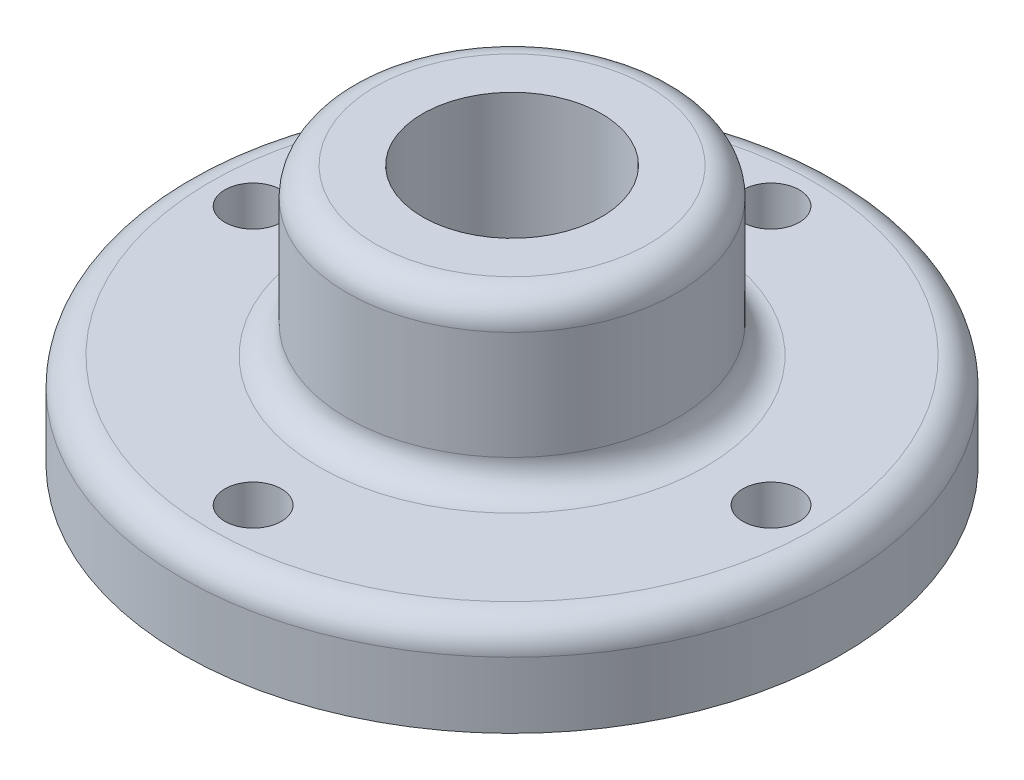
ISO-10303-21;
HEADER;
FILE_DESCRIPTION(('STEP AP214'),'2;1');
FILE_NAME('part.step','',(''),(''),'','','');
FILE_SCHEMA(('AUTOMOTIVE_DESIGN { 1 0 10303 214 1 1 1 1 }'));
ENDSEC;
DATA;
#1=APPLICATION_CONTEXT('core data for automotive mechanical design processes');
#2=APPLICATION_PROTOCOL_DEFINITION('international standard','automotive_design',2000,#1);
#3=PRODUCT_CONTEXT('',#1,'mechanical');
#4=PRODUCT('Part','Part','',(#3));
#5=PRODUCT_RELATED_PRODUCT_CATEGORY('part','',(#4));
#6=PRODUCT_DEFINITION_FORMATION('','',#4);
#7=PRODUCT_DEFINITION_CONTEXT('part definition',#1,'design');
#8=PRODUCT_DEFINITION('design','',#6,#7);
#9=PRODUCT_DEFINITION_SHAPE('','',#8);
#10=(LENGTH_UNIT() NAMED_UNIT(*) SI_UNIT(.MILLI.,.METRE.));
#11=(NAMED_UNIT(*) PLANE_ANGLE_UNIT() SI_UNIT($,.RADIAN.));
#12=(NAMED_UNIT(*) SI_UNIT($,.STERADIAN.) SOLID_ANGLE_UNIT());
#13=UNCERTAINTY_MEASURE_WITH_UNIT(LENGTH_MEASURE(1.E-05),#10,'distance_accuracy_value','');
#14=(GEOMETRIC_REPRESENTATION_CONTEXT(3) GLOBAL_UNCERTAINTY_ASSIGNED_CONTEXT((#13)) GLOBAL_UNIT_ASSIGNED_CONTEXT((#10,
#11,#12)) REPRESENTATION_CONTEXT('',''));
#15=CARTESIAN_POINT('',(0.,0.,0.));
#16=DIRECTION('',(0.,0.,1.));
#17=DIRECTION('',(1.,0.,0.));
#18=AXIS2_PLACEMENT_3D('',#15,#16,#17);
#19=CARTESIAN_POINT('',(-55.,20.,0.));
#20=DIRECTION('',(0.,-1.,0.));
#21=DIRECTION('',(0.,0.,-1.));
#22=AXIS2_PLACEMENT_3D('',#19,#20,#21);
#23=CYLINDRICAL_SURFACE('',#22,5.99999999999999);
#24=CARTESIAN_POINT('',(-55.,20.,0.));
#25=DIRECTION('',(0.,1.,0.));
#26=DIRECTION('',(0.,0.,1.));
#27=AXIS2_PLACEMENT_3D('',#24,#25,#26);
#28=CIRCLE('',#27,5.99999999999999);
#29=CARTESIAN_POINT('',(-55.,20.,5.99999999999999));
#30=VERTEX_POINT('',#29);
#31=EDGE_CURVE('E57',#30,#30,#28,.T.);
#32=ORIENTED_EDGE('',*,*,#31,.T.);
#33=EDGE_LOOP('',(#32));
#34=FACE_BOUND('',#33,.T.);
#35=CARTESIAN_POINT('',(-55.,0.,0.));
#36=DIRECTION('',(0.,1.,0.));
#37=DIRECTION('',(0.,0.,1.));
#38=AXIS2_PLACEMENT_3D('',#35,#36,#37);
#39=CIRCLE('',#38,5.99999999999999);
#40=CARTESIAN_POINT('',(-55.,0.,5.99999999999999));
#41=VERTEX_POINT('',#40);
#42=EDGE_CURVE('E62',#41,#41,#39,.T.);
#43=ORIENTED_EDGE('',*,*,#42,.F.);
#44=EDGE_LOOP('',(#43));
#45=FACE_BOUND('',#44,.T.);
#46=ADVANCED_FACE('F31',(#34,#45),#23,.F.);
#47=CARTESIAN_POINT('',(0.,20.,-55.));
#48=DIRECTION('',(0.,-1.,0.));
#49=DIRECTION('',(0.,0.,-1.));
#50=AXIS2_PLACEMENT_3D('',#47,#48,#49);
#51=CYLINDRICAL_SURFACE('',#50,6.);
#52=CARTESIAN_POINT('',(0.,20.,-55.));
#53=DIRECTION('',(0.,1.,0.));
#54=DIRECTION('',(0.,0.,1.));
#55=AXIS2_PLACEMENT_3D('',#52,#53,#54);
#56=CIRCLE('',#55,6.);
#57=CARTESIAN_POINT('',(0.,20.,-49.));
#58=VERTEX_POINT('',#57);
#59=EDGE_CURVE('E77',#58,#58,#56,.T.);
#60=ORIENTED_EDGE('',*,*,#59,.T.);
#61=EDGE_LOOP('',(#60));
#62=FACE_BOUND('',#61,.T.);
#63=CARTESIAN_POINT('',(0.,0.,-55.));
#64=DIRECTION('',(0.,1.,0.));
#65=DIRECTION('',(0.,0.,1.));
#66=AXIS2_PLACEMENT_3D('',#63,#64,#65);
#67=CIRCLE('',#66,6.);
#68=CARTESIAN_POINT('',(0.,0.,-49.));
#69=VERTEX_POINT('',#68);
#70=EDGE_CURVE('E65',#69,#69,#67,.T.);
#71=ORIENTED_EDGE('',*,*,#70,.F.);
#72=EDGE_LOOP('',(#71));
#73=FACE_BOUND('',#72,.T.);
#74=ADVANCED_FACE('F110',(#62,#73),#51,.F.);
#75=CARTESIAN_POINT('',(55.,20.,0.));
#76=DIRECTION('',(0.,-1.,0.));
#77=DIRECTION('',(0.,0.,-1.));
#78=AXIS2_PLACEMENT_3D('',#75,#76,#77);
#79=CYLINDRICAL_SURFACE('',#78,5.99999999999999);
#80=CARTESIAN_POINT('',(55.,20.,0.));
#81=DIRECTION('',(0.,1.,0.));
#82=DIRECTION('',(0.,0.,1.));
#83=AXIS2_PLACEMENT_3D('',#80,#81,#82);
#84=CIRCLE('',#83,5.99999999999999);
#85=CARTESIAN_POINT('',(55.,20.,5.99999999999999));
#86=VERTEX_POINT('',#85);
#87=EDGE_CURVE('E80',#86,#86,#84,.T.);
#88=ORIENTED_EDGE('',*,*,#87,.T.);
#89=EDGE_LOOP('',(#88));
#90=FACE_BOUND('',#89,.T.);
#91=CARTESIAN_POINT('',(55.,0.,0.));
#92=DIRECTION('',(0.,1.,0.));
#93=DIRECTION('',(0.,0.,1.));
#94=AXIS2_PLACEMENT_3D('',#91,#92,#93);
#95=CIRCLE('',#94,5.99999999999999);
#96=CARTESIAN_POINT('',(55.,0.,5.99999999999999));
#97=VERTEX_POINT('',#96);
#98=EDGE_CURVE('E68',#97,#97,#95,.T.);
#99=ORIENTED_EDGE('',*,*,#98,.F.);
#100=EDGE_LOOP('',(#99));
#101=FACE_BOUND('',#100,.T.);
#102=ADVANCED_FACE('F116',(#90,#101),#79,.F.);
#103=CARTESIAN_POINT('',(0.,20.,55.));
#104=DIRECTION('',(0.,-1.,0.));
#105=DIRECTION('',(0.,0.,-1.));
#106=AXIS2_PLACEMENT_3D('',#103,#104,#105);
#107=CYLINDRICAL_SURFACE('',#106,6.);
#108=CARTESIAN_POINT('',(0.,20.,55.));
#109=DIRECTION('',(0.,1.,0.));
#110=DIRECTION('',(0.,0.,1.));
#111=AXIS2_PLACEMENT_3D('',#108,#109,#110);
#112=CIRCLE('',#111,6.);
#113=CARTESIAN_POINT('',(0.,20.,61.));
#114=VERTEX_POINT('',#113);
#115=EDGE_CURVE('E61',#114,#114,#112,.T.);
#116=ORIENTED_EDGE('',*,*,#115,.T.);
#117=EDGE_LOOP('',(#116));
#118=FACE_BOUND('',#117,.T.);
#119=CARTESIAN_POINT('',(0.,0.,55.));
#120=DIRECTION('',(0.,1.,0.));
#121=DIRECTION('',(0.,0.,1.));
#122=AXIS2_PLACEMENT_3D('',#119,#120,#121);
#123=CIRCLE('',#122,6.);
#124=CARTESIAN_POINT('',(0.,0.,61.));
#125=VERTEX_POINT('',#124);
#126=EDGE_CURVE('E71',#125,#125,#123,.T.);
#127=ORIENTED_EDGE('',*,*,#126,.F.);
#128=EDGE_LOOP('',(#127));
#129=FACE_BOUND('',#128,.T.);
#130=ADVANCED_FACE('F126',(#118,#129),#107,.F.);
#131=CARTESIAN_POINT('',(0.,20.,0.));
#132=DIRECTION('',(0.,-1.,0.));
#133=DIRECTION('',(0.,0.,-1.));
#134=AXIS2_PLACEMENT_3D('',#131,#132,#133);
#135=CYLINDRICAL_SURFACE('',#134,70.);
#136=CARTESIAN_POINT('',(0.,14.,0.));
#137=DIRECTION('',(0.,1.,0.));
#138=DIRECTION('',(0.,0.,1.));
#139=AXIS2_PLACEMENT_3D('',#136,#137,#138);
#140=CIRCLE('',#139,70.);
#141=CARTESIAN_POINT('',(0.,14.,70.));
#142=VERTEX_POINT('',#141);
#143=EDGE_CURVE('E46',#142,#142,#140,.F.);
#144=ORIENTED_EDGE('',*,*,#143,.T.);
#145=EDGE_LOOP('',(#144));
#146=FACE_BOUND('',#145,.T.);
#147=CARTESIAN_POINT('',(0.,0.,0.));
#148=DIRECTION('',(0.,1.,0.));
#149=DIRECTION('',(0.,0.,1.));
#150=AXIS2_PLACEMENT_3D('',#147,#148,#149);
#151=CIRCLE('',#150,70.);
#152=CARTESIAN_POINT('',(0.,0.,70.));
#153=VERTEX_POINT('',#152);
#154=EDGE_CURVE('E58',#153,#153,#151,.T.);
#155=ORIENTED_EDGE('',*,*,#154,.T.);
#156=EDGE_LOOP('',(#155));
#157=FACE_BOUND('',#156,.T.);
#158=ADVANCED_FACE('F121',(#146,#157),#135,.T.);
#159=CARTESIAN_POINT('',(0.,20.,0.));
#160=DIRECTION('',(0.,1.,0.));
#161=DIRECTION('',(0.,0.,1.));
#162=AXIS2_PLACEMENT_3D('',#159,#160,#161);
#163=PLANE('',#162);
#164=CARTESIAN_POINT('',(0.,20.,0.));
#165=DIRECTION('',(0.,1.,0.));
#166=DIRECTION('',(0.,0.,1.));
#167=AXIS2_PLACEMENT_3D('',#164,#165,#166);
#168=CIRCLE('',#167,64.);
#169=CARTESIAN_POINT('',(0.,20.,64.));
#170=VERTEX_POINT('',#169);
#171=EDGE_CURVE('E51',#170,#170,#168,.T.);
#172=ORIENTED_EDGE('',*,*,#171,.T.);
#173=EDGE_LOOP('',(#172));
#174=FACE_BOUND('',#173,.T.);
#175=CARTESIAN_POINT('',(0.,20.,0.));
#176=DIRECTION('',(0.,1.,0.));
#177=DIRECTION('',(0.,0.,1.));
#178=AXIS2_PLACEMENT_3D('',#175,#176,#177);
#179=CIRCLE('',#178,41.);
#180=CARTESIAN_POINT('',(0.,20.,41.));
#181=VERTEX_POINT('',#180);
#182=EDGE_CURVE('E54',#181,#181,#179,.F.);
#183=ORIENTED_EDGE('',*,*,#182,.T.);
#184=EDGE_LOOP('',(#183));
#185=FACE_BOUND('',#184,.T.);
#186=ORIENTED_EDGE('',*,*,#115,.F.);
#187=EDGE_LOOP('',(#186));
#188=FACE_BOUND('',#187,.T.);
#189=ORIENTED_EDGE('',*,*,#87,.F.);
#190=EDGE_LOOP('',(#189));
#191=FACE_BOUND('',#190,.T.);
#192=ORIENTED_EDGE('',*,*,#59,.F.);
#193=EDGE_LOOP('',(#192));
#194=FACE_BOUND('',#193,.T.);
#195=ORIENTED_EDGE('',*,*,#31,.F.);
#196=EDGE_LOOP('',(#195));
#197=FACE_BOUND('',#196,.T.);
#198=ADVANCED_FACE('F143',(#174,#185,#188,#191,#194,#197),#163,.T.);
#199=CARTESIAN_POINT('',(0.,0.,0.));
#200=DIRECTION('',(0.,1.,0.));
#201=DIRECTION('',(0.,0.,1.));
#202=AXIS2_PLACEMENT_3D('',#199,#200,#201);
#203=PLANE('',#202);
#204=CARTESIAN_POINT('',(0.,0.,0.));
#205=DIRECTION('',(0.,1.,0.));
#206=DIRECTION('',(0.,0.,1.));
#207=AXIS2_PLACEMENT_3D('',#204,#205,#206);
#208=CIRCLE('',#207,19.);
#209=CARTESIAN_POINT('',(0.,0.,19.));
#210=VERTEX_POINT('',#209);
#211=EDGE_CURVE('E74',#210,#210,#208,.T.);
#212=ORIENTED_EDGE('',*,*,#211,.T.);
#213=EDGE_LOOP('',(#212));
#214=FACE_BOUND('',#213,.T.);
#215=ORIENTED_EDGE('',*,*,#126,.T.);
#216=EDGE_LOOP('',(#215));
#217=FACE_BOUND('',#216,.T.);
#218=ORIENTED_EDGE('',*,*,#98,.T.);
#219=EDGE_LOOP('',(#218));
#220=FACE_BOUND('',#219,.T.);
#221=ORIENTED_EDGE('',*,*,#70,.T.);
#222=EDGE_LOOP('',(#221));
#223=FACE_BOUND('',#222,.T.);
#224=ORIENTED_EDGE('',*,*,#42,.T.);
#225=EDGE_LOOP('',(#224));
#226=FACE_BOUND('',#225,.T.);
#227=ORIENTED_EDGE('',*,*,#154,.F.);
#228=EDGE_LOOP('',(#227));
#229=FACE_BOUND('',#228,.T.);
#230=ADVANCED_FACE('F91',(#214,#217,#220,#223,#226,#229),#203,.F.);
#231=CARTESIAN_POINT('',(0.,55.,0.));
#232=DIRECTION('',(0.,-1.,0.));
#233=DIRECTION('',(0.,0.,-1.));
#234=AXIS2_PLACEMENT_3D('',#231,#232,#233);
#235=CYLINDRICAL_SURFACE('',#234,35.);
#236=CARTESIAN_POINT('',(0.,26.,0.));
#237=DIRECTION('',(0.,1.,0.));
#238=DIRECTION('',(0.,0.,1.));
#239=AXIS2_PLACEMENT_3D('',#236,#237,#238);
#240=CIRCLE('',#239,35.);
#241=CARTESIAN_POINT('',(0.,26.,35.));
#242=VERTEX_POINT('',#241);
#243=EDGE_CURVE('E38',#242,#242,#240,.T.);
#244=ORIENTED_EDGE('',*,*,#243,.T.);
#245=EDGE_LOOP('',(#244));
#246=FACE_BOUND('',#245,.T.);
#247=CARTESIAN_POINT('',(0.,49.,0.));
#248=DIRECTION('',(0.,1.,0.));
#249=DIRECTION('',(0.,0.,1.));
#250=AXIS2_PLACEMENT_3D('',#247,#248,#249);
#251=CIRCLE('',#250,35.);
#252=CARTESIAN_POINT('',(0.,49.,35.));
#253=VERTEX_POINT('',#252);
#254=EDGE_CURVE('E42',#253,#253,#251,.F.);
#255=ORIENTED_EDGE('',*,*,#254,.T.);
#256=EDGE_LOOP('',(#255));
#257=FACE_BOUND('',#256,.T.);
#258=ADVANCED_FACE('F103',(#246,#257),#235,.T.);
#259=CARTESIAN_POINT('',(0.,55.,0.));
#260=DIRECTION('',(0.,1.,0.));
#261=DIRECTION('',(0.,0.,1.));
#262=AXIS2_PLACEMENT_3D('',#259,#260,#261);
#263=PLANE('',#262);
#264=CARTESIAN_POINT('',(0.,55.,0.));
#265=DIRECTION('',(0.,1.,0.));
#266=DIRECTION('',(0.,0.,1.));
#267=AXIS2_PLACEMENT_3D('',#264,#265,#266);
#268=CIRCLE('',#267,29.);
#269=CARTESIAN_POINT('',(0.,55.,29.));
#270=VERTEX_POINT('',#269);
#271=EDGE_CURVE('E10',#270,#270,#268,.T.);
#272=ORIENTED_EDGE('',*,*,#271,.T.);
#273=EDGE_LOOP('',(#272));
#274=FACE_BOUND('',#273,.T.);
#275=CARTESIAN_POINT('',(0.,55.,0.));
#276=DIRECTION('',(0.,1.,0.));
#277=DIRECTION('',(0.,0.,1.));
#278=AXIS2_PLACEMENT_3D('',#275,#276,#277);
#279=CIRCLE('',#278,19.);
#280=CARTESIAN_POINT('',(0.,55.,19.));
#281=VERTEX_POINT('',#280);
#282=EDGE_CURVE('E85',#281,#281,#279,.T.);
#283=ORIENTED_EDGE('',*,*,#282,.F.);
#284=EDGE_LOOP('',(#283));
#285=FACE_BOUND('',#284,.T.);
#286=ADVANCED_FACE('F98',(#274,#285),#263,.T.);
#287=CARTESIAN_POINT('',(0.,0.,0.));
#288=DIRECTION('',(0.,1.,0.));
#289=DIRECTION('',(0.,0.,1.));
#290=AXIS2_PLACEMENT_3D('',#287,#288,#289);
#291=CYLINDRICAL_SURFACE('',#290,19.);
#292=ORIENTED_EDGE('',*,*,#211,.F.);
#293=EDGE_LOOP('',(#292));
#294=FACE_BOUND('',#293,.T.);
#295=ORIENTED_EDGE('',*,*,#282,.T.);
#296=EDGE_LOOP('',(#295));
#297=FACE_BOUND('',#296,.T.);
#298=ADVANCED_FACE('F94',(#294,#297),#291,.F.);
#299=CARTESIAN_POINT('',(0.,14.,0.));
#300=DIRECTION('',(0.,1.,0.));
#301=DIRECTION('',(0.,0.,1.));
#302=AXIS2_PLACEMENT_3D('',#299,#300,#301);
#303=TOROIDAL_SURFACE('',#302,64.,6.);
#304=ORIENTED_EDGE('',*,*,#143,.F.);
#305=EDGE_LOOP('',(#304));
#306=FACE_BOUND('',#305,.T.);
#307=ORIENTED_EDGE('',*,*,#171,.F.);
#308=EDGE_LOOP('',(#307));
#309=FACE_BOUND('',#308,.T.);
#310=ADVANCED_FACE('F97',(#306,#309),#303,.T.);
#311=CARTESIAN_POINT('',(0.,26.,0.));
#312=DIRECTION('',(0.,1.,0.));
#313=DIRECTION('',(0.,0.,1.));
#314=AXIS2_PLACEMENT_3D('',#311,#312,#313);
#315=TOROIDAL_SURFACE('',#314,41.,6.);
#316=ORIENTED_EDGE('',*,*,#182,.F.);
#317=EDGE_LOOP('',(#316));
#318=FACE_BOUND('',#317,.T.);
#319=ORIENTED_EDGE('',*,*,#243,.F.);
#320=EDGE_LOOP('',(#319));
#321=FACE_BOUND('',#320,.T.);
#322=ADVANCED_FACE('F132',(#318,#321),#315,.F.);
#323=CARTESIAN_POINT('',(0.,49.,0.));
#324=DIRECTION('',(0.,1.,0.));
#325=DIRECTION('',(0.,0.,1.));
#326=AXIS2_PLACEMENT_3D('',#323,#324,#325);
#327=TOROIDAL_SURFACE('',#326,29.,6.);
#328=ORIENTED_EDGE('',*,*,#254,.F.);
#329=EDGE_LOOP('',(#328));
#330=FACE_BOUND('',#329,.T.);
#331=ORIENTED_EDGE('',*,*,#271,.F.);
#332=EDGE_LOOP('',(#331));
#333=FACE_BOUND('',#332,.T.);
#334=ADVANCED_FACE('F33',(#330,#333),#327,.T.);
#335=CLOSED_SHELL('',(#46,#74,#102,#130,#158,#198,#230,#258,#286,#298,#310,#322,#334));
#336=MANIFOLD_SOLID_BREP('B2',#335);
#337=ADVANCED_BREP_SHAPE_REPRESENTATION('',(#18,#336),#14);
#338=SHAPE_DEFINITION_REPRESENTATION(#9,#337);
ENDSEC;
END-ISO-10303-21;
